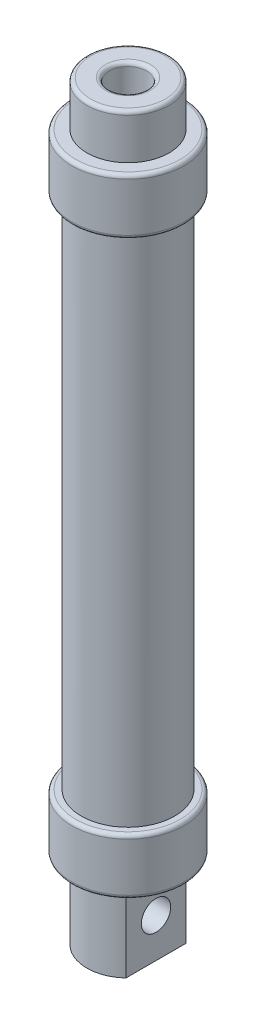
ISO-10303-21;
HEADER;
FILE_DESCRIPTION(('STEP AP214'),'2;1');
FILE_NAME('part.step','',(''),(''),'','','');
FILE_SCHEMA(('AUTOMOTIVE_DESIGN { 1 0 10303 214 1 1 1 1 }'));
ENDSEC;
DATA;
#1=APPLICATION_CONTEXT('core data for automotive mechanical design processes');
#2=APPLICATION_PROTOCOL_DEFINITION('international standard','automotive_design',2000,#1);
#3=PRODUCT_CONTEXT('',#1,'mechanical');
#4=PRODUCT('Part','Part','',(#3));
#5=PRODUCT_RELATED_PRODUCT_CATEGORY('part','',(#4));
#6=PRODUCT_DEFINITION_FORMATION('','',#4);
#7=PRODUCT_DEFINITION_CONTEXT('part definition',#1,'design');
#8=PRODUCT_DEFINITION('design','',#6,#7);
#9=PRODUCT_DEFINITION_SHAPE('','',#8);
#10=(LENGTH_UNIT() NAMED_UNIT(*) SI_UNIT(.MILLI.,.METRE.));
#11=(NAMED_UNIT(*) PLANE_ANGLE_UNIT() SI_UNIT($,.RADIAN.));
#12=(NAMED_UNIT(*) SI_UNIT($,.STERADIAN.) SOLID_ANGLE_UNIT());
#13=UNCERTAINTY_MEASURE_WITH_UNIT(LENGTH_MEASURE(1.E-05),#10,'distance_accuracy_value','');
#14=(GEOMETRIC_REPRESENTATION_CONTEXT(3) GLOBAL_UNCERTAINTY_ASSIGNED_CONTEXT((#13)) GLOBAL_UNIT_ASSIGNED_CONTEXT((#10,
#11,#12)) REPRESENTATION_CONTEXT('',''));
#15=CARTESIAN_POINT('',(0.,0.,0.));
#16=DIRECTION('',(0.,0.,1.));
#17=DIRECTION('',(1.,0.,0.));
#18=AXIS2_PLACEMENT_3D('',#15,#16,#17);
#19=CARTESIAN_POINT('',(0.,165.,0.));
#20=DIRECTION('',(0.,1.,0.));
#21=DIRECTION('',(0.,0.,1.));
#22=AXIS2_PLACEMENT_3D('',#19,#20,#21);
#23=TOROIDAL_SURFACE('',#22,6.,1.);
#24=CARTESIAN_POINT('',(0.,165.,0.));
#25=DIRECTION('',(0.,1.,0.));
#26=DIRECTION('',(0.,0.,1.));
#27=AXIS2_PLACEMENT_3D('',#24,#25,#26);
#28=CIRCLE('',#27,5.);
#29=CARTESIAN_POINT('',(0.,165.,5.));
#30=VERTEX_POINT('',#29);
#31=EDGE_CURVE('E44',#30,#30,#28,.T.);
#32=ORIENTED_EDGE('',*,*,#31,.F.);
#33=EDGE_LOOP('',(#32));
#34=FACE_BOUND('',#33,.T.);
#35=CARTESIAN_POINT('',(0.,166.,0.));
#36=DIRECTION('',(0.,1.,0.));
#37=DIRECTION('',(0.,0.,1.));
#38=AXIS2_PLACEMENT_3D('',#35,#36,#37);
#39=CIRCLE('',#38,6.);
#40=CARTESIAN_POINT('',(0.,166.,6.));
#41=VERTEX_POINT('',#40);
#42=EDGE_CURVE('E11',#41,#41,#39,.F.);
#43=ORIENTED_EDGE('',*,*,#42,.F.);
#44=EDGE_LOOP('',(#43));
#45=FACE_BOUND('',#44,.T.);
#46=ADVANCED_FACE('F37',(#34,#45),#23,.T.);
#47=CARTESIAN_POINT('',(0.,165.,0.));
#48=DIRECTION('',(0.,1.,0.));
#49=DIRECTION('',(0.,0.,1.));
#50=AXIS2_PLACEMENT_3D('',#47,#48,#49);
#51=TOROIDAL_SURFACE('',#50,10.,1.);
#52=CARTESIAN_POINT('',(0.,166.,0.));
#53=DIRECTION('',(0.,1.,0.));
#54=DIRECTION('',(0.,0.,1.));
#55=AXIS2_PLACEMENT_3D('',#52,#53,#54);
#56=CIRCLE('',#55,10.);
#57=CARTESIAN_POINT('',(0.,166.,10.));
#58=VERTEX_POINT('',#57);
#59=EDGE_CURVE('E150',#58,#58,#56,.T.);
#60=ORIENTED_EDGE('',*,*,#59,.F.);
#61=EDGE_LOOP('',(#60));
#62=FACE_BOUND('',#61,.T.);
#63=CARTESIAN_POINT('',(0.,165.,0.));
#64=DIRECTION('',(0.,1.,0.));
#65=DIRECTION('',(0.,0.,1.));
#66=AXIS2_PLACEMENT_3D('',#63,#64,#65);
#67=CIRCLE('',#66,11.);
#68=CARTESIAN_POINT('',(0.,165.,11.));
#69=VERTEX_POINT('',#68);
#70=EDGE_CURVE('E161',#69,#69,#67,.F.);
#71=ORIENTED_EDGE('',*,*,#70,.F.);
#72=EDGE_LOOP('',(#71));
#73=FACE_BOUND('',#72,.T.);
#74=ADVANCED_FACE('F171',(#62,#73),#51,.T.);
#75=CARTESIAN_POINT('',(0.,-13.,0.));
#76=DIRECTION('',(0.,-1.,0.));
#77=DIRECTION('',(0.,0.,-1.));
#78=AXIS2_PLACEMENT_3D('',#75,#76,#77);
#79=PLANE('',#78);
#80=CARTESIAN_POINT('',(0.,-13.,0.));
#81=DIRECTION('',(0.,-1.,0.));
#82=DIRECTION('',(0.,0.,-1.));
#83=AXIS2_PLACEMENT_3D('',#80,#81,#82);
#84=CIRCLE('',#83,11.5527670918556);
#85=CARTESIAN_POINT('',(0.,-13.,-11.5527670918556));
#86=VERTEX_POINT('',#85);
#87=EDGE_CURVE('E147',#86,#86,#84,.F.);
#88=ORIENTED_EDGE('',*,*,#87,.T.);
#89=EDGE_LOOP('',(#88));
#90=FACE_BOUND('',#89,.T.);
#91=ADVANCED_FACE('F183',(#90),#79,.F.);
#92=CARTESIAN_POINT('',(0.,153.,0.));
#93=DIRECTION('',(0.,1.,0.));
#94=DIRECTION('',(0.,0.,1.));
#95=AXIS2_PLACEMENT_3D('',#92,#93,#94);
#96=PLANE('',#95);
#97=CARTESIAN_POINT('',(0.,153.,0.));
#98=DIRECTION('',(0.,1.,0.));
#99=DIRECTION('',(0.,0.,1.));
#100=AXIS2_PLACEMENT_3D('',#97,#98,#99);
#101=CIRCLE('',#100,5.);
#102=CARTESIAN_POINT('',(0.,153.,5.));
#103=VERTEX_POINT('',#102);
#104=EDGE_CURVE('E155',#103,#103,#101,.T.);
#105=ORIENTED_EDGE('',*,*,#104,.T.);
#106=EDGE_LOOP('',(#105));
#107=FACE_BOUND('',#106,.T.);
#108=CARTESIAN_POINT('',(0.,153.,0.));
#109=DIRECTION('',(0.,1.,0.));
#110=DIRECTION('',(0.,0.,1.));
#111=AXIS2_PLACEMENT_3D('',#108,#109,#110);
#112=CIRCLE('',#111,11.5437645875116);
#113=CARTESIAN_POINT('',(0.,153.,11.5437645875116));
#114=VERTEX_POINT('',#113);
#115=EDGE_CURVE('E144',#114,#114,#112,.F.);
#116=ORIENTED_EDGE('',*,*,#115,.T.);
#117=EDGE_LOOP('',(#116));
#118=FACE_BOUND('',#117,.T.);
#119=ADVANCED_FACE('F225',(#107,#118),#96,.F.);
#120=CARTESIAN_POINT('',(0.,139.,0.));
#121=DIRECTION('',(0.,1.,0.));
#122=DIRECTION('',(0.,0.,1.));
#123=AXIS2_PLACEMENT_3D('',#120,#121,#122);
#124=CYLINDRICAL_SURFACE('',#123,11.5437645875116);
#125=CARTESIAN_POINT('',(0.,140.,0.));
#126=DIRECTION('',(0.,1.,0.));
#127=DIRECTION('',(0.,0.,1.));
#128=AXIS2_PLACEMENT_3D('',#125,#126,#127);
#129=CIRCLE('',#128,11.5437645875116);
#130=CARTESIAN_POINT('',(0.,140.,11.5437645875116));
#131=VERTEX_POINT('',#130);
#132=EDGE_CURVE('E109',#131,#131,#129,.T.);
#133=ORIENTED_EDGE('',*,*,#132,.F.);
#134=EDGE_LOOP('',(#133));
#135=FACE_BOUND('',#134,.T.);
#136=ORIENTED_EDGE('',*,*,#115,.F.);
#137=EDGE_LOOP('',(#136));
#138=FACE_BOUND('',#137,.T.);
#139=ADVANCED_FACE('F229',(#135,#138),#124,.F.);
#140=CARTESIAN_POINT('',(0.,140.,0.));
#141=DIRECTION('',(0.,1.,0.));
#142=DIRECTION('',(0.,0.,1.));
#143=AXIS2_PLACEMENT_3D('',#140,#141,#142);
#144=PLANE('',#143);
#145=CARTESIAN_POINT('',(0.,140.,0.));
#146=DIRECTION('',(0.,1.,0.));
#147=DIRECTION('',(0.,0.,1.));
#148=AXIS2_PLACEMENT_3D('',#145,#146,#147);
#149=CIRCLE('',#148,10.5);
#150=CARTESIAN_POINT('',(0.,140.,10.5));
#151=VERTEX_POINT('',#150);
#152=EDGE_CURVE('E102',#151,#151,#149,.T.);
#153=ORIENTED_EDGE('',*,*,#152,.F.);
#154=EDGE_LOOP('',(#153));
#155=FACE_BOUND('',#154,.T.);
#156=ORIENTED_EDGE('',*,*,#132,.T.);
#157=EDGE_LOOP('',(#156));
#158=FACE_BOUND('',#157,.T.);
#159=ADVANCED_FACE('F254',(#155,#158),#144,.T.);
#160=CARTESIAN_POINT('',(0.,140.,0.));
#161=DIRECTION('',(0.,-1.,0.));
#162=DIRECTION('',(0.,0.,-1.));
#163=AXIS2_PLACEMENT_3D('',#160,#161,#162);
#164=CYLINDRICAL_SURFACE('',#163,10.5);
#165=ORIENTED_EDGE('',*,*,#152,.T.);
#166=EDGE_LOOP('',(#165));
#167=FACE_BOUND('',#166,.T.);
#168=CARTESIAN_POINT('',(0.,0.,0.));
#169=DIRECTION('',(0.,1.,0.));
#170=DIRECTION('',(0.,0.,1.));
#171=AXIS2_PLACEMENT_3D('',#168,#169,#170);
#172=CIRCLE('',#171,10.5);
#173=CARTESIAN_POINT('',(0.,0.,10.5));
#174=VERTEX_POINT('',#173);
#175=EDGE_CURVE('E106',#174,#174,#172,.T.);
#176=ORIENTED_EDGE('',*,*,#175,.F.);
#177=EDGE_LOOP('',(#176));
#178=FACE_BOUND('',#177,.T.);
#179=ADVANCED_FACE('F264',(#167,#178),#164,.F.);
#180=CARTESIAN_POINT('',(0.,0.,0.));
#181=DIRECTION('',(0.,1.,0.));
#182=DIRECTION('',(0.,0.,1.));
#183=AXIS2_PLACEMENT_3D('',#180,#181,#182);
#184=PLANE('',#183);
#185=ORIENTED_EDGE('',*,*,#175,.T.);
#186=EDGE_LOOP('',(#185));
#187=FACE_BOUND('',#186,.T.);
#188=CARTESIAN_POINT('',(0.,0.,0.));
#189=DIRECTION('',(0.,1.,0.));
#190=DIRECTION('',(0.,0.,1.));
#191=AXIS2_PLACEMENT_3D('',#188,#189,#190);
#192=CIRCLE('',#191,11.5527670918556);
#193=CARTESIAN_POINT('',(0.,0.,11.5527670918556));
#194=VERTEX_POINT('',#193);
#195=EDGE_CURVE('E112',#194,#194,#192,.T.);
#196=ORIENTED_EDGE('',*,*,#195,.F.);
#197=EDGE_LOOP('',(#196));
#198=FACE_BOUND('',#197,.T.);
#199=ADVANCED_FACE('F238',(#187,#198),#184,.F.);
#200=CARTESIAN_POINT('',(0.,1.,0.));
#201=DIRECTION('',(0.,-1.,0.));
#202=DIRECTION('',(0.,0.,-1.));
#203=AXIS2_PLACEMENT_3D('',#200,#201,#202);
#204=CYLINDRICAL_SURFACE('',#203,11.5527670918556);
#205=ORIENTED_EDGE('',*,*,#195,.T.);
#206=EDGE_LOOP('',(#205));
#207=FACE_BOUND('',#206,.T.);
#208=ORIENTED_EDGE('',*,*,#87,.F.);
#209=EDGE_LOOP('',(#208));
#210=FACE_BOUND('',#209,.T.);
#211=ADVANCED_FACE('F235',(#207,#210),#204,.F.);
#212=CARTESIAN_POINT('',(0.,146.,0.));
#213=DIRECTION('',(0.,1.,0.));
#214=DIRECTION('',(0.,0.,1.));
#215=AXIS2_PLACEMENT_3D('',#212,#213,#214);
#216=CYLINDRICAL_SURFACE('',#215,5.);
#217=ORIENTED_EDGE('',*,*,#31,.T.);
#218=EDGE_LOOP('',(#217));
#219=FACE_BOUND('',#218,.T.);
#220=ORIENTED_EDGE('',*,*,#104,.F.);
#221=EDGE_LOOP('',(#220));
#222=FACE_BOUND('',#221,.T.);
#223=ADVANCED_FACE('F166',(#219,#222),#216,.F.);
#224=CARTESIAN_POINT('',(0.,154.,0.));
#225=DIRECTION('',(0.,1.,0.));
#226=DIRECTION('',(0.,0.,1.));
#227=AXIS2_PLACEMENT_3D('',#224,#225,#226);
#228=PLANE('',#227);
#229=CARTESIAN_POINT('',(0.,154.,0.));
#230=DIRECTION('',(0.,1.,0.));
#231=DIRECTION('',(0.,0.,1.));
#232=AXIS2_PLACEMENT_3D('',#229,#230,#231);
#233=CIRCLE('',#232,14.);
#234=CARTESIAN_POINT('',(0.,154.,14.));
#235=VERTEX_POINT('',#234);
#236=EDGE_CURVE('E132',#235,#235,#233,.T.);
#237=ORIENTED_EDGE('',*,*,#236,.T.);
#238=EDGE_LOOP('',(#237));
#239=FACE_BOUND('',#238,.T.);
#240=CARTESIAN_POINT('',(0.,154.,0.));
#241=DIRECTION('',(0.,1.,0.));
#242=DIRECTION('',(0.,0.,1.));
#243=AXIS2_PLACEMENT_3D('',#240,#241,#242);
#244=CIRCLE('',#243,11.);
#245=CARTESIAN_POINT('',(0.,154.,11.));
#246=VERTEX_POINT('',#245);
#247=EDGE_CURVE('E158',#246,#246,#244,.T.);
#248=ORIENTED_EDGE('',*,*,#247,.F.);
#249=EDGE_LOOP('',(#248));
#250=FACE_BOUND('',#249,.T.);
#251=ADVANCED_FACE('F248',(#239,#250),#228,.T.);
#252=CARTESIAN_POINT('',(0.,-35.,0.));
#253=DIRECTION('',(0.,1.,0.));
#254=DIRECTION('',(0.,0.,1.));
#255=AXIS2_PLACEMENT_3D('',#252,#253,#254);
#256=CYLINDRICAL_SURFACE('',#255,11.);
#257=CARTESIAN_POINT('',(0.,-35.,0.));
#258=DIRECTION('',(0.,-1.,0.));
#259=DIRECTION('',(0.,0.,-1.));
#260=AXIS2_PLACEMENT_3D('',#257,#258,#259);
#261=CIRCLE('',#260,11.);
#262=CARTESIAN_POINT('',(7.5,-35.,8.04673846971554));
#263=VERTEX_POINT('',#262);
#264=CARTESIAN_POINT('',(-7.5,-35.,8.04673846971554));
#265=VERTEX_POINT('',#264);
#266=EDGE_CURVE('E95',#263,#265,#261,.T.);
#267=ORIENTED_EDGE('',*,*,#266,.F.);
#268=DIRECTION('',(0.,-1.,0.));
#269=VECTOR('',#268,1.);
#270=CARTESIAN_POINT('',(7.5,-14.,8.04673846971554));
#271=LINE('',#270,#269);
#272=CARTESIAN_POINT('',(7.5,-14.,8.04673846971554));
#273=VERTEX_POINT('',#272);
#274=EDGE_CURVE('E51',#273,#263,#271,.T.);
#275=ORIENTED_EDGE('',*,*,#274,.F.);
#276=CARTESIAN_POINT('',(0.,-14.,0.));
#277=DIRECTION('',(0.,-1.,0.));
#278=DIRECTION('',(0.,0.,-1.));
#279=AXIS2_PLACEMENT_3D('',#276,#277,#278);
#280=CIRCLE('',#279,11.);
#281=CARTESIAN_POINT('',(-7.5,-14.,8.04673846971554));
#282=VERTEX_POINT('',#281);
#283=EDGE_CURVE('E84',#273,#282,#280,.T.);
#284=ORIENTED_EDGE('',*,*,#283,.T.);
#285=DIRECTION('',(0.,-1.,0.));
#286=VECTOR('',#285,1.);
#287=CARTESIAN_POINT('',(-7.5,-14.,8.04673846971554));
#288=LINE('',#287,#286);
#289=EDGE_CURVE('E99',#282,#265,#288,.T.);
#290=ORIENTED_EDGE('',*,*,#289,.T.);
#291=EDGE_LOOP('',(#267,#275,#284,#290));
#292=FACE_BOUND('',#291,.T.);
#293=ADVANCED_FACE('F207',(#292),#256,.T.);
#294=CARTESIAN_POINT('',(0.,-14.,0.));
#295=DIRECTION('',(0.,-1.,0.));
#296=DIRECTION('',(0.,0.,-1.));
#297=AXIS2_PLACEMENT_3D('',#294,#295,#296);
#298=PLANE('',#297);
#299=CARTESIAN_POINT('',(0.,-14.,0.));
#300=DIRECTION('',(0.,-1.,0.));
#301=DIRECTION('',(0.,0.,-1.));
#302=AXIS2_PLACEMENT_3D('',#299,#300,#301);
#303=CIRCLE('',#302,14.);
#304=CARTESIAN_POINT('',(0.,-14.,-14.));
#305=VERTEX_POINT('',#304);
#306=EDGE_CURVE('E141',#305,#305,#303,.T.);
#307=ORIENTED_EDGE('',*,*,#306,.T.);
#308=EDGE_LOOP('',(#307));
#309=FACE_BOUND('',#308,.T.);
#310=CARTESIAN_POINT('',(-7.5,-14.,-8.04673846971554));
#311=VERTEX_POINT('',#310);
#312=CARTESIAN_POINT('',(7.5,-14.,-8.04673846971554));
#313=VERTEX_POINT('',#312);
#314=EDGE_CURVE('E83',#311,#313,#280,.T.);
#315=ORIENTED_EDGE('',*,*,#314,.F.);
#316=DIRECTION('',(0.,0.,1.));
#317=VECTOR('',#316,1.);
#318=CARTESIAN_POINT('',(-7.5,-14.,0.));
#319=LINE('',#318,#317);
#320=EDGE_CURVE('E200',#311,#282,#319,.T.);
#321=ORIENTED_EDGE('',*,*,#320,.T.);
#322=ORIENTED_EDGE('',*,*,#283,.F.);
#323=DIRECTION('',(0.,0.,-1.));
#324=VECTOR('',#323,1.);
#325=CARTESIAN_POINT('',(7.5,-14.,8.04673846971554));
#326=LINE('',#325,#324);
#327=EDGE_CURVE('E78',#273,#313,#326,.T.);
#328=ORIENTED_EDGE('',*,*,#327,.T.);
#329=EDGE_LOOP('',(#315,#321,#322,#328));
#330=FACE_BOUND('',#329,.T.);
#331=ADVANCED_FACE('F80',(#309,#330),#298,.T.);
#332=CARTESIAN_POINT('',(0.,-13.,0.));
#333=DIRECTION('',(0.,-1.,0.));
#334=DIRECTION('',(0.,0.,-1.));
#335=AXIS2_PLACEMENT_3D('',#332,#333,#334);
#336=TOROIDAL_SURFACE('',#335,14.,1.);
#337=CARTESIAN_POINT('',(0.,-13.,0.));
#338=DIRECTION('',(0.,-1.,0.));
#339=DIRECTION('',(0.,0.,-1.));
#340=AXIS2_PLACEMENT_3D('',#337,#338,#339);
#341=CIRCLE('',#340,15.);
#342=CARTESIAN_POINT('',(0.,-13.,-15.));
#343=VERTEX_POINT('',#342);
#344=EDGE_CURVE('E138',#343,#343,#341,.F.);
#345=ORIENTED_EDGE('',*,*,#344,.F.);
#346=EDGE_LOOP('',(#345));
#347=FACE_BOUND('',#346,.T.);
#348=ORIENTED_EDGE('',*,*,#306,.F.);
#349=EDGE_LOOP('',(#348));
#350=FACE_BOUND('',#349,.T.);
#351=ADVANCED_FACE('F233',(#347,#350),#336,.T.);
#352=CARTESIAN_POINT('',(0.,153.,0.));
#353=DIRECTION('',(0.,1.,0.));
#354=DIRECTION('',(0.,0.,1.));
#355=AXIS2_PLACEMENT_3D('',#352,#353,#354);
#356=TOROIDAL_SURFACE('',#355,14.,1.);
#357=ORIENTED_EDGE('',*,*,#236,.F.);
#358=EDGE_LOOP('',(#357));
#359=FACE_BOUND('',#358,.T.);
#360=CARTESIAN_POINT('',(0.,153.,0.));
#361=DIRECTION('',(0.,1.,0.));
#362=DIRECTION('',(0.,0.,1.));
#363=AXIS2_PLACEMENT_3D('',#360,#361,#362);
#364=CIRCLE('',#363,15.);
#365=CARTESIAN_POINT('',(0.,153.,15.));
#366=VERTEX_POINT('',#365);
#367=EDGE_CURVE('E135',#366,#366,#364,.F.);
#368=ORIENTED_EDGE('',*,*,#367,.F.);
#369=EDGE_LOOP('',(#368));
#370=FACE_BOUND('',#369,.T.);
#371=ADVANCED_FACE('F284',(#359,#370),#356,.T.);
#372=CARTESIAN_POINT('',(0.,0.,0.));
#373=DIRECTION('',(0.,-1.,0.));
#374=DIRECTION('',(0.,0.,-1.));
#375=AXIS2_PLACEMENT_3D('',#372,#373,#374);
#376=TOROIDAL_SURFACE('',#375,14.,1.);
#377=CARTESIAN_POINT('',(0.,0.,0.));
#378=DIRECTION('',(0.,-1.,0.));
#379=DIRECTION('',(0.,0.,-1.));
#380=AXIS2_PLACEMENT_3D('',#377,#378,#379);
#381=CIRCLE('',#380,15.);
#382=CARTESIAN_POINT('',(0.,0.,-15.));
#383=VERTEX_POINT('',#382);
#384=EDGE_CURVE('E126',#383,#383,#381,.T.);
#385=ORIENTED_EDGE('',*,*,#384,.F.);
#386=EDGE_LOOP('',(#385));
#387=FACE_BOUND('',#386,.T.);
#388=CARTESIAN_POINT('',(0.,1.,0.));
#389=DIRECTION('',(0.,-1.,0.));
#390=DIRECTION('',(0.,0.,-1.));
#391=AXIS2_PLACEMENT_3D('',#388,#389,#390);
#392=CIRCLE('',#391,14.);
#393=CARTESIAN_POINT('',(0.,1.,-14.));
#394=VERTEX_POINT('',#393);
#395=EDGE_CURVE('E129',#394,#394,#392,.F.);
#396=ORIENTED_EDGE('',*,*,#395,.F.);
#397=EDGE_LOOP('',(#396));
#398=FACE_BOUND('',#397,.T.);
#399=ADVANCED_FACE('F280',(#387,#398),#376,.T.);
#400=CARTESIAN_POINT('',(0.,140.,0.));
#401=DIRECTION('',(0.,1.,0.));
#402=DIRECTION('',(0.,0.,1.));
#403=AXIS2_PLACEMENT_3D('',#400,#401,#402);
#404=TOROIDAL_SURFACE('',#403,14.,1.);
#405=CARTESIAN_POINT('',(0.,140.,0.));
#406=DIRECTION('',(0.,1.,0.));
#407=DIRECTION('',(0.,0.,1.));
#408=AXIS2_PLACEMENT_3D('',#405,#406,#407);
#409=CIRCLE('',#408,15.);
#410=CARTESIAN_POINT('',(0.,140.,15.));
#411=VERTEX_POINT('',#410);
#412=EDGE_CURVE('E120',#411,#411,#409,.T.);
#413=ORIENTED_EDGE('',*,*,#412,.F.);
#414=EDGE_LOOP('',(#413));
#415=FACE_BOUND('',#414,.T.);
#416=CARTESIAN_POINT('',(0.,139.,0.));
#417=DIRECTION('',(0.,1.,0.));
#418=DIRECTION('',(0.,0.,1.));
#419=AXIS2_PLACEMENT_3D('',#416,#417,#418);
#420=CIRCLE('',#419,14.);
#421=CARTESIAN_POINT('',(0.,139.,14.));
#422=VERTEX_POINT('',#421);
#423=EDGE_CURVE('E123',#422,#422,#420,.F.);
#424=ORIENTED_EDGE('',*,*,#423,.F.);
#425=EDGE_LOOP('',(#424));
#426=FACE_BOUND('',#425,.T.);
#427=ADVANCED_FACE('F276',(#415,#426),#404,.T.);
#428=CARTESIAN_POINT('',(0.,140.,0.));
#429=DIRECTION('',(0.,-1.,0.));
#430=DIRECTION('',(0.,0.,-1.));
#431=AXIS2_PLACEMENT_3D('',#428,#429,#430);
#432=CYLINDRICAL_SURFACE('',#431,12.5);
#433=CARTESIAN_POINT('',(0.,139.,0.));
#434=DIRECTION('',(0.,1.,0.));
#435=DIRECTION('',(0.,0.,1.));
#436=AXIS2_PLACEMENT_3D('',#433,#434,#435);
#437=CIRCLE('',#436,12.5);
#438=CARTESIAN_POINT('',(0.,139.,12.5));
#439=VERTEX_POINT('',#438);
#440=EDGE_CURVE('E105',#439,#439,#437,.T.);
#441=ORIENTED_EDGE('',*,*,#440,.F.);
#442=EDGE_LOOP('',(#441));
#443=FACE_BOUND('',#442,.T.);
#444=CARTESIAN_POINT('',(0.,1.,0.));
#445=DIRECTION('',(0.,-1.,0.));
#446=DIRECTION('',(0.,0.,-1.));
#447=AXIS2_PLACEMENT_3D('',#444,#445,#446);
#448=CIRCLE('',#447,12.5);
#449=CARTESIAN_POINT('',(0.,1.,-12.5));
#450=VERTEX_POINT('',#449);
#451=EDGE_CURVE('E117',#450,#450,#448,.T.);
#452=ORIENTED_EDGE('',*,*,#451,.F.);
#453=EDGE_LOOP('',(#452));
#454=FACE_BOUND('',#453,.T.);
#455=ADVANCED_FACE('F259',(#443,#454),#432,.T.);
#456=CARTESIAN_POINT('',(0.,139.,0.));
#457=DIRECTION('',(0.,1.,0.));
#458=DIRECTION('',(0.,0.,1.));
#459=AXIS2_PLACEMENT_3D('',#456,#457,#458);
#460=PLANE('',#459);
#461=ORIENTED_EDGE('',*,*,#423,.T.);
#462=EDGE_LOOP('',(#461));
#463=FACE_BOUND('',#462,.T.);
#464=ORIENTED_EDGE('',*,*,#440,.T.);
#465=EDGE_LOOP('',(#464));
#466=FACE_BOUND('',#465,.T.);
#467=ADVANCED_FACE('F256',(#463,#466),#460,.F.);
#468=CARTESIAN_POINT('',(0.,139.,0.));
#469=DIRECTION('',(0.,1.,0.));
#470=DIRECTION('',(0.,0.,1.));
#471=AXIS2_PLACEMENT_3D('',#468,#469,#470);
#472=CYLINDRICAL_SURFACE('',#471,15.);
#473=ORIENTED_EDGE('',*,*,#367,.T.);
#474=EDGE_LOOP('',(#473));
#475=FACE_BOUND('',#474,.T.);
#476=ORIENTED_EDGE('',*,*,#412,.T.);
#477=EDGE_LOOP('',(#476));
#478=FACE_BOUND('',#477,.T.);
#479=ADVANCED_FACE('F243',(#475,#478),#472,.T.);
#480=CARTESIAN_POINT('',(0.,1.,0.));
#481=DIRECTION('',(0.,-1.,0.));
#482=DIRECTION('',(0.,0.,-1.));
#483=AXIS2_PLACEMENT_3D('',#480,#481,#482);
#484=PLANE('',#483);
#485=ORIENTED_EDGE('',*,*,#395,.T.);
#486=EDGE_LOOP('',(#485));
#487=FACE_BOUND('',#486,.T.);
#488=ORIENTED_EDGE('',*,*,#451,.T.);
#489=EDGE_LOOP('',(#488));
#490=FACE_BOUND('',#489,.T.);
#491=ADVANCED_FACE('F240',(#487,#490),#484,.F.);
#492=CARTESIAN_POINT('',(0.,1.,0.));
#493=DIRECTION('',(0.,-1.,0.));
#494=DIRECTION('',(0.,0.,-1.));
#495=AXIS2_PLACEMENT_3D('',#492,#493,#494);
#496=CYLINDRICAL_SURFACE('',#495,15.);
#497=ORIENTED_EDGE('',*,*,#344,.T.);
#498=EDGE_LOOP('',(#497));
#499=FACE_BOUND('',#498,.T.);
#500=ORIENTED_EDGE('',*,*,#384,.T.);
#501=EDGE_LOOP('',(#500));
#502=FACE_BOUND('',#501,.T.);
#503=ADVANCED_FACE('F219',(#499,#502),#496,.T.);
#504=ORIENTED_EDGE('',*,*,#314,.T.);
#505=DIRECTION('',(0.,-1.,0.));
#506=VECTOR('',#505,1.);
#507=CARTESIAN_POINT('',(7.5,-14.,-8.04673846971554));
#508=LINE('',#507,#506);
#509=CARTESIAN_POINT('',(7.5,-35.,-8.04673846971554));
#510=VERTEX_POINT('',#509);
#511=EDGE_CURVE('E85',#313,#510,#508,.T.);
#512=ORIENTED_EDGE('',*,*,#511,.T.);
#513=CARTESIAN_POINT('',(-7.5,-35.,-8.04673846971554));
#514=VERTEX_POINT('',#513);
#515=EDGE_CURVE('E97',#514,#510,#261,.T.);
#516=ORIENTED_EDGE('',*,*,#515,.F.);
#517=DIRECTION('',(0.,-1.,0.));
#518=VECTOR('',#517,1.);
#519=CARTESIAN_POINT('',(-7.5,-14.,-8.04673846971554));
#520=LINE('',#519,#518);
#521=EDGE_CURVE('E59',#311,#514,#520,.T.);
#522=ORIENTED_EDGE('',*,*,#521,.F.);
#523=EDGE_LOOP('',(#504,#512,#516,#522));
#524=FACE_BOUND('',#523,.T.);
#525=ADVANCED_FACE('F94',(#524),#256,.T.);
#526=CARTESIAN_POINT('',(0.,-35.,0.));
#527=DIRECTION('',(0.,-1.,0.));
#528=DIRECTION('',(0.,0.,-1.));
#529=AXIS2_PLACEMENT_3D('',#526,#527,#528);
#530=PLANE('',#529);
#531=DIRECTION('',(0.,0.,-1.));
#532=VECTOR('',#531,1.);
#533=CARTESIAN_POINT('',(7.5,-35.,0.));
#534=LINE('',#533,#532);
#535=EDGE_CURVE('E86',#263,#510,#534,.T.);
#536=ORIENTED_EDGE('',*,*,#535,.F.);
#537=ORIENTED_EDGE('',*,*,#266,.T.);
#538=DIRECTION('',(0.,0.,1.));
#539=VECTOR('',#538,1.);
#540=CARTESIAN_POINT('',(-7.5,-35.,8.04673846971554));
#541=LINE('',#540,#539);
#542=EDGE_CURVE('E198',#514,#265,#541,.T.);
#543=ORIENTED_EDGE('',*,*,#542,.F.);
#544=ORIENTED_EDGE('',*,*,#515,.T.);
#545=EDGE_LOOP('',(#536,#537,#543,#544));
#546=FACE_BOUND('',#545,.T.);
#547=ADVANCED_FACE('F210',(#546),#530,.T.);
#548=CARTESIAN_POINT('',(-7.5,-14.,8.04673846971554));
#549=DIRECTION('',(1.,0.,0.));
#550=DIRECTION('',(0.,0.,-1.));
#551=AXIS2_PLACEMENT_3D('',#548,#549,#550);
#552=PLANE('',#551);
#553=CARTESIAN_POINT('',(-7.5,-24.5,0.));
#554=DIRECTION('',(-1.,0.,0.));
#555=DIRECTION('',(0.,0.,1.));
#556=AXIS2_PLACEMENT_3D('',#553,#554,#555);
#557=CIRCLE('',#556,3.935);
#558=CARTESIAN_POINT('',(-7.5,-24.5,3.935));
#559=VERTEX_POINT('',#558);
#560=EDGE_CURVE('E154',#559,#559,#557,.T.);
#561=ORIENTED_EDGE('',*,*,#560,.F.);
#562=EDGE_LOOP('',(#561));
#563=FACE_BOUND('',#562,.T.);
#564=ORIENTED_EDGE('',*,*,#542,.T.);
#565=ORIENTED_EDGE('',*,*,#289,.F.);
#566=ORIENTED_EDGE('',*,*,#320,.F.);
#567=ORIENTED_EDGE('',*,*,#521,.T.);
#568=EDGE_LOOP('',(#564,#565,#566,#567));
#569=FACE_BOUND('',#568,.T.);
#570=ADVANCED_FACE('F208',(#563,#569),#552,.F.);
#571=CARTESIAN_POINT('',(7.5,-14.,0.));
#572=DIRECTION('',(-1.,0.,0.));
#573=DIRECTION('',(0.,0.,1.));
#574=AXIS2_PLACEMENT_3D('',#571,#572,#573);
#575=PLANE('',#574);
#576=CARTESIAN_POINT('',(7.5,-24.5,0.));
#577=DIRECTION('',(-1.,0.,0.));
#578=DIRECTION('',(0.,0.,1.));
#579=AXIS2_PLACEMENT_3D('',#576,#577,#578);
#580=CIRCLE('',#579,3.935);
#581=CARTESIAN_POINT('',(7.5,-24.5,3.935));
#582=VERTEX_POINT('',#581);
#583=EDGE_CURVE('E151',#582,#582,#580,.T.);
#584=ORIENTED_EDGE('',*,*,#583,.T.);
#585=EDGE_LOOP('',(#584));
#586=FACE_BOUND('',#585,.T.);
#587=ORIENTED_EDGE('',*,*,#535,.T.);
#588=ORIENTED_EDGE('',*,*,#511,.F.);
#589=ORIENTED_EDGE('',*,*,#327,.F.);
#590=ORIENTED_EDGE('',*,*,#274,.T.);
#591=EDGE_LOOP('',(#587,#588,#589,#590));
#592=FACE_BOUND('',#591,.T.);
#593=ADVANCED_FACE('F89',(#586,#592),#575,.F.);
#594=CARTESIAN_POINT('',(15.,-24.5,0.));
#595=DIRECTION('',(-1.,0.,0.));
#596=DIRECTION('',(0.,0.,1.));
#597=AXIS2_PLACEMENT_3D('',#594,#595,#596);
#598=CYLINDRICAL_SURFACE('',#597,3.935);
#599=ORIENTED_EDGE('',*,*,#560,.T.);
#600=EDGE_LOOP('',(#599));
#601=FACE_BOUND('',#600,.T.);
#602=ORIENTED_EDGE('',*,*,#583,.F.);
#603=EDGE_LOOP('',(#602));
#604=FACE_BOUND('',#603,.T.);
#605=ADVANCED_FACE('F188',(#601,#604),#598,.F.);
#606=CARTESIAN_POINT('',(0.,166.,0.));
#607=DIRECTION('',(0.,-1.,0.));
#608=DIRECTION('',(0.,0.,-1.));
#609=AXIS2_PLACEMENT_3D('',#606,#607,#608);
#610=CYLINDRICAL_SURFACE('',#609,11.);
#611=ORIENTED_EDGE('',*,*,#70,.T.);
#612=EDGE_LOOP('',(#611));
#613=FACE_BOUND('',#612,.T.);
#614=ORIENTED_EDGE('',*,*,#247,.T.);
#615=EDGE_LOOP('',(#614));
#616=FACE_BOUND('',#615,.T.);
#617=ADVANCED_FACE('F177',(#613,#616),#610,.T.);
#618=CARTESIAN_POINT('',(0.,166.,0.));
#619=DIRECTION('',(0.,1.,0.));
#620=DIRECTION('',(0.,0.,1.));
#621=AXIS2_PLACEMENT_3D('',#618,#619,#620);
#622=PLANE('',#621);
#623=ORIENTED_EDGE('',*,*,#42,.T.);
#624=EDGE_LOOP('',(#623));
#625=FACE_BOUND('',#624,.T.);
#626=ORIENTED_EDGE('',*,*,#59,.T.);
#627=EDGE_LOOP('',(#626));
#628=FACE_BOUND('',#627,.T.);
#629=ADVANCED_FACE('F174',(#625,#628),#622,.T.);
#630=CLOSED_SHELL('',(#46,#74,#91,#119,#139,#159,#179,#199,#211,#223,#251,#293,#331,#351,#371,
#399,#427,#455,#467,#479,#491,#503,#525,#547,#570,#593,#605,#617,#629));
#631=MANIFOLD_SOLID_BREP('B2',#630);
#632=ADVANCED_BREP_SHAPE_REPRESENTATION('',(#18,#631),#14);
#633=SHAPE_DEFINITION_REPRESENTATION(#9,#632);
ENDSEC;
END-ISO-10303-21;
